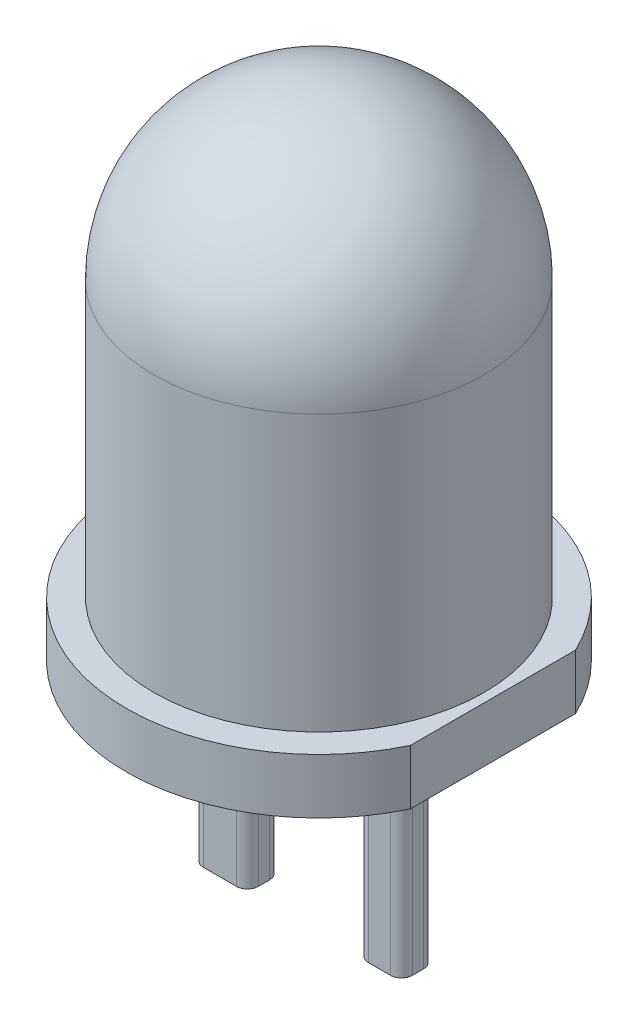
ISO-10303-21;
HEADER;
FILE_DESCRIPTION(('STEP AP214'),'2;1');
FILE_NAME('part.step','',(''),(''),'','','');
FILE_SCHEMA(('AUTOMOTIVE_DESIGN { 1 0 10303 214 1 1 1 1 }'));
ENDSEC;
DATA;
#1=APPLICATION_CONTEXT('core data for automotive mechanical design processes');
#2=APPLICATION_PROTOCOL_DEFINITION('international standard','automotive_design',2000,#1);
#3=PRODUCT_CONTEXT('',#1,'mechanical');
#4=PRODUCT('Part','Part','',(#3));
#5=PRODUCT_RELATED_PRODUCT_CATEGORY('part','',(#4));
#6=PRODUCT_DEFINITION_FORMATION('','',#4);
#7=PRODUCT_DEFINITION_CONTEXT('part definition',#1,'design');
#8=PRODUCT_DEFINITION('design','',#6,#7);
#9=PRODUCT_DEFINITION_SHAPE('','',#8);
#10=(LENGTH_UNIT() NAMED_UNIT(*) SI_UNIT(.MILLI.,.METRE.));
#11=(NAMED_UNIT(*) PLANE_ANGLE_UNIT() SI_UNIT($,.RADIAN.));
#12=(NAMED_UNIT(*) SI_UNIT($,.STERADIAN.) SOLID_ANGLE_UNIT());
#13=UNCERTAINTY_MEASURE_WITH_UNIT(LENGTH_MEASURE(1.E-05),#10,'distance_accuracy_value','');
#14=(GEOMETRIC_REPRESENTATION_CONTEXT(3) GLOBAL_UNCERTAINTY_ASSIGNED_CONTEXT((#13)) GLOBAL_UNIT_ASSIGNED_CONTEXT((#10,
#11,#12)) REPRESENTATION_CONTEXT('',''));
#15=CARTESIAN_POINT('',(0.,0.,0.));
#16=DIRECTION('',(0.,0.,1.));
#17=DIRECTION('',(1.,0.,0.));
#18=AXIS2_PLACEMENT_3D('',#15,#16,#17);
#19=CARTESIAN_POINT('',(0.,0.,0.));
#20=DIRECTION('',(0.,1.,0.));
#21=DIRECTION('',(0.,0.,1.));
#22=AXIS2_PLACEMENT_3D('',#19,#20,#21);
#23=PLANE('',#22);
#24=CARTESIAN_POINT('',(0.8,0.,0.05));
#25=DIRECTION('',(0.,-1.,0.));
#26=DIRECTION('',(0.,0.,1.));
#27=AXIS2_PLACEMENT_3D('',#24,#25,#26);
#28=CIRCLE('',#27,0.1);
#29=CARTESIAN_POINT('',(0.9,0.,0.0499999999999993));
#30=VERTEX_POINT('',#29);
#31=CARTESIAN_POINT('',(0.799999999999999,0.,0.15));
#32=VERTEX_POINT('',#31);
#33=EDGE_CURVE('E190',#30,#32,#28,.T.);
#34=ORIENTED_EDGE('',*,*,#33,.F.);
#35=DIRECTION('',(0.,0.,1.));
#36=VECTOR('',#35,1.);
#37=CARTESIAN_POINT('',(0.9,0.,0.0499999999999993));
#38=LINE('',#37,#36);
#39=CARTESIAN_POINT('',(0.9,0.,-0.0499999999999993));
#40=VERTEX_POINT('',#39);
#41=EDGE_CURVE('E203',#40,#30,#38,.T.);
#42=ORIENTED_EDGE('',*,*,#41,.F.);
#43=CARTESIAN_POINT('',(0.8,0.,-0.05));
#44=DIRECTION('',(0.,-1.,0.));
#45=DIRECTION('',(0.,0.,-1.));
#46=AXIS2_PLACEMENT_3D('',#43,#44,#45);
#47=CIRCLE('',#46,0.1);
#48=CARTESIAN_POINT('',(0.799999999999999,0.,-0.15));
#49=VERTEX_POINT('',#48);
#50=EDGE_CURVE('E232',#49,#40,#47,.T.);
#51=ORIENTED_EDGE('',*,*,#50,.F.);
#52=DIRECTION('',(1.,0.,0.));
#53=VECTOR('',#52,1.);
#54=CARTESIAN_POINT('',(0.600000000000001,0.,-0.15));
#55=LINE('',#54,#53);
#56=CARTESIAN_POINT('',(0.600000000000001,0.,-0.15));
#57=VERTEX_POINT('',#56);
#58=EDGE_CURVE('E229',#57,#49,#55,.T.);
#59=ORIENTED_EDGE('',*,*,#58,.F.);
#60=CARTESIAN_POINT('',(0.6,0.,-0.05));
#61=DIRECTION('',(0.,-1.,0.));
#62=DIRECTION('',(0.,0.,-1.));
#63=AXIS2_PLACEMENT_3D('',#60,#61,#62);
#64=CIRCLE('',#63,0.1);
#65=CARTESIAN_POINT('',(0.5,0.,-0.0499999999999993));
#66=VERTEX_POINT('',#65);
#67=EDGE_CURVE('E226',#66,#57,#64,.T.);
#68=ORIENTED_EDGE('',*,*,#67,.F.);
#69=DIRECTION('',(0.,0.,-1.));
#70=VECTOR('',#69,1.);
#71=CARTESIAN_POINT('',(0.5,0.,0.0499999999999993));
#72=LINE('',#71,#70);
#73=CARTESIAN_POINT('',(0.5,0.,0.0499999999999993));
#74=VERTEX_POINT('',#73);
#75=EDGE_CURVE('E223',#74,#66,#72,.T.);
#76=ORIENTED_EDGE('',*,*,#75,.F.);
#77=CARTESIAN_POINT('',(0.6,0.,0.05));
#78=DIRECTION('',(0.,-1.,0.));
#79=DIRECTION('',(0.,0.,-1.));
#80=AXIS2_PLACEMENT_3D('',#77,#78,#79);
#81=CIRCLE('',#80,0.1);
#82=CARTESIAN_POINT('',(0.6,0.,0.15));
#83=VERTEX_POINT('',#82);
#84=EDGE_CURVE('E220',#83,#74,#81,.T.);
#85=ORIENTED_EDGE('',*,*,#84,.F.);
#86=DIRECTION('',(-1.,0.,0.));
#87=VECTOR('',#86,1.);
#88=CARTESIAN_POINT('',(0.600000000000001,0.,0.15));
#89=LINE('',#88,#87);
#90=EDGE_CURVE('E193',#32,#83,#89,.T.);
#91=ORIENTED_EDGE('',*,*,#90,.F.);
#92=EDGE_LOOP('',(#34,#42,#51,#59,#68,#76,#85,#91));
#93=FACE_BOUND('',#92,.T.);
#94=CARTESIAN_POINT('',(0.,0.,0.));
#95=DIRECTION('',(0.,-1.,0.));
#96=DIRECTION('',(0.,0.,-1.));
#97=AXIS2_PLACEMENT_3D('',#94,#95,#96);
#98=CIRCLE('',#97,1.75);
#99=CARTESIAN_POINT('',(1.58113883008419,0.,0.75));
#100=VERTEX_POINT('',#99);
#101=CARTESIAN_POINT('',(1.58113883008419,0.,-0.75));
#102=VERTEX_POINT('',#101);
#103=EDGE_CURVE('E52',#100,#102,#98,.T.);
#104=ORIENTED_EDGE('',*,*,#103,.T.);
#105=DIRECTION('',(0.,0.,-1.));
#106=VECTOR('',#105,1.);
#107=CARTESIAN_POINT('',(1.58113883008419,0.,-0.75));
#108=LINE('',#107,#106);
#109=EDGE_CURVE('E260',#100,#102,#108,.T.);
#110=ORIENTED_EDGE('',*,*,#109,.F.);
#111=EDGE_LOOP('',(#104,#110));
#112=FACE_BOUND('',#111,.T.);
#113=CARTESIAN_POINT('',(-0.6,0.,-0.05));
#114=DIRECTION('',(0.,-1.,0.));
#115=DIRECTION('',(0.,0.,-1.));
#116=AXIS2_PLACEMENT_3D('',#113,#114,#115);
#117=CIRCLE('',#116,0.1);
#118=CARTESIAN_POINT('',(-0.600000000000001,0.,-0.15));
#119=VERTEX_POINT('',#118);
#120=CARTESIAN_POINT('',(-0.5,0.,-0.0499999999999993));
#121=VERTEX_POINT('',#120);
#122=EDGE_CURVE('E189',#119,#121,#117,.T.);
#123=ORIENTED_EDGE('',*,*,#122,.F.);
#124=DIRECTION('',(1.,0.,0.));
#125=VECTOR('',#124,1.);
#126=CARTESIAN_POINT('',(-0.899999999999999,0.,-0.15));
#127=LINE('',#126,#125);
#128=CARTESIAN_POINT('',(-0.899999999999999,0.,-0.15));
#129=VERTEX_POINT('',#128);
#130=EDGE_CURVE('E186',#129,#119,#127,.T.);
#131=ORIENTED_EDGE('',*,*,#130,.F.);
#132=CARTESIAN_POINT('',(-0.9,0.,-0.05));
#133=DIRECTION('',(0.,-1.,0.));
#134=DIRECTION('',(0.,0.,-1.));
#135=AXIS2_PLACEMENT_3D('',#132,#133,#134);
#136=CIRCLE('',#135,0.1);
#137=CARTESIAN_POINT('',(-1.,0.,-0.0499999999999993));
#138=VERTEX_POINT('',#137);
#139=EDGE_CURVE('E515',#138,#129,#136,.T.);
#140=ORIENTED_EDGE('',*,*,#139,.F.);
#141=DIRECTION('',(0.,0.,-1.));
#142=VECTOR('',#141,1.);
#143=CARTESIAN_POINT('',(-1.,0.,0.0499999999999993));
#144=LINE('',#143,#142);
#145=CARTESIAN_POINT('',(-1.,0.,0.0499999999999993));
#146=VERTEX_POINT('',#145);
#147=EDGE_CURVE('E546',#146,#138,#144,.T.);
#148=ORIENTED_EDGE('',*,*,#147,.F.);
#149=CARTESIAN_POINT('',(-0.9,0.,0.05));
#150=DIRECTION('',(0.,-1.,0.));
#151=DIRECTION('',(0.,0.,-1.));
#152=AXIS2_PLACEMENT_3D('',#149,#150,#151);
#153=CIRCLE('',#152,0.1);
#154=CARTESIAN_POINT('',(-0.9,0.,0.15));
#155=VERTEX_POINT('',#154);
#156=EDGE_CURVE('E539',#155,#146,#153,.T.);
#157=ORIENTED_EDGE('',*,*,#156,.F.);
#158=DIRECTION('',(-1.,0.,0.));
#159=VECTOR('',#158,1.);
#160=CARTESIAN_POINT('',(-0.899999999999999,0.,0.15));
#161=LINE('',#160,#159);
#162=CARTESIAN_POINT('',(-0.600000000000001,0.,0.15));
#163=VERTEX_POINT('',#162);
#164=EDGE_CURVE('E536',#163,#155,#161,.T.);
#165=ORIENTED_EDGE('',*,*,#164,.F.);
#166=CARTESIAN_POINT('',(-0.6,0.,0.05));
#167=DIRECTION('',(0.,-1.,0.));
#168=DIRECTION('',(0.,0.,1.));
#169=AXIS2_PLACEMENT_3D('',#166,#167,#168);
#170=CIRCLE('',#169,0.1);
#171=CARTESIAN_POINT('',(-0.5,0.,0.0499999999999993));
#172=VERTEX_POINT('',#171);
#173=EDGE_CURVE('E64',#172,#163,#170,.T.);
#174=ORIENTED_EDGE('',*,*,#173,.F.);
#175=DIRECTION('',(0.,0.,1.));
#176=VECTOR('',#175,1.);
#177=CARTESIAN_POINT('',(-0.5,0.,0.0499999999999993));
#178=LINE('',#177,#176);
#179=EDGE_CURVE('E59',#121,#172,#178,.T.);
#180=ORIENTED_EDGE('',*,*,#179,.F.);
#181=EDGE_LOOP('',(#123,#131,#140,#148,#157,#165,#174,#180));
#182=FACE_BOUND('',#181,.T.);
#183=ADVANCED_FACE('F45',(#93,#112,#182),#23,.F.);
#184=CARTESIAN_POINT('',(0.,0.,0.));
#185=DIRECTION('',(0.,-1.,0.));
#186=DIRECTION('',(0.,0.,-1.));
#187=AXIS2_PLACEMENT_3D('',#184,#185,#186);
#188=CYLINDRICAL_SURFACE('',#187,1.75);
#189=CARTESIAN_POINT('',(0.,0.5,0.));
#190=DIRECTION('',(0.,-1.,0.));
#191=DIRECTION('',(0.,0.,-1.));
#192=AXIS2_PLACEMENT_3D('',#189,#190,#191);
#193=CIRCLE('',#192,1.75);
#194=CARTESIAN_POINT('',(1.58113883008419,0.5,0.75));
#195=VERTEX_POINT('',#194);
#196=CARTESIAN_POINT('',(1.58113883008419,0.5,-0.75));
#197=VERTEX_POINT('',#196);
#198=EDGE_CURVE('E273',#195,#197,#193,.T.);
#199=ORIENTED_EDGE('',*,*,#198,.T.);
#200=DIRECTION('',(0.,-1.,0.));
#201=VECTOR('',#200,1.);
#202=CARTESIAN_POINT('',(1.58113883008419,1.,-0.75));
#203=LINE('',#202,#201);
#204=EDGE_CURVE('E263',#197,#102,#203,.T.);
#205=ORIENTED_EDGE('',*,*,#204,.T.);
#206=ORIENTED_EDGE('',*,*,#103,.F.);
#207=DIRECTION('',(0.,-1.,0.));
#208=VECTOR('',#207,1.);
#209=CARTESIAN_POINT('',(1.58113883008419,1.,0.75));
#210=LINE('',#209,#208);
#211=EDGE_CURVE('E262',#195,#100,#210,.T.);
#212=ORIENTED_EDGE('',*,*,#211,.F.);
#213=EDGE_LOOP('',(#199,#205,#206,#212));
#214=FACE_BOUND('',#213,.T.);
#215=ADVANCED_FACE('F281',(#214),#188,.T.);
#216=CARTESIAN_POINT('',(-1.75,0.5,0.));
#217=DIRECTION('',(0.,-1.,0.));
#218=DIRECTION('',(0.,0.,-1.));
#219=AXIS2_PLACEMENT_3D('',#216,#217,#218);
#220=PLANE('',#219);
#221=ORIENTED_EDGE('',*,*,#198,.F.);
#222=DIRECTION('',(0.,0.,-1.));
#223=VECTOR('',#222,1.);
#224=CARTESIAN_POINT('',(1.58113883008419,0.5,0.));
#225=LINE('',#224,#223);
#226=EDGE_CURVE('E11',#195,#197,#225,.T.);
#227=ORIENTED_EDGE('',*,*,#226,.T.);
#228=EDGE_LOOP('',(#221,#227));
#229=FACE_BOUND('',#228,.T.);
#230=CARTESIAN_POINT('',(0.,0.5,0.));
#231=DIRECTION('',(0.,-1.,0.));
#232=DIRECTION('',(0.,0.,-1.));
#233=AXIS2_PLACEMENT_3D('',#230,#231,#232);
#234=CIRCLE('',#233,1.5);
#235=CARTESIAN_POINT('',(0.,0.5,-1.5));
#236=VERTEX_POINT('',#235);
#237=EDGE_CURVE('E270',#236,#236,#234,.T.);
#238=ORIENTED_EDGE('',*,*,#237,.T.);
#239=EDGE_LOOP('',(#238));
#240=FACE_BOUND('',#239,.T.);
#241=ADVANCED_FACE('F286',(#229,#240),#220,.F.);
#242=CARTESIAN_POINT('',(0.,0.,0.));
#243=DIRECTION('',(0.,-1.,0.));
#244=DIRECTION('',(0.,0.,-1.));
#245=AXIS2_PLACEMENT_3D('',#242,#243,#244);
#246=CYLINDRICAL_SURFACE('',#245,1.5);
#247=ORIENTED_EDGE('',*,*,#237,.F.);
#248=EDGE_LOOP('',(#247));
#249=FACE_BOUND('',#248,.T.);
#250=CARTESIAN_POINT('',(0.,3.00000000000001,0.));
#251=DIRECTION('',(0.,-1.,0.));
#252=DIRECTION('',(0.,0.,-1.));
#253=AXIS2_PLACEMENT_3D('',#250,#251,#252);
#254=CIRCLE('',#253,1.5);
#255=CARTESIAN_POINT('',(0.,3.00000000000001,-1.5));
#256=VERTEX_POINT('',#255);
#257=EDGE_CURVE('E266',#256,#256,#254,.T.);
#258=ORIENTED_EDGE('',*,*,#257,.T.);
#259=EDGE_LOOP('',(#258));
#260=FACE_BOUND('',#259,.T.);
#261=ADVANCED_FACE('F289',(#249,#260),#246,.T.);
#262=CARTESIAN_POINT('',(0.,3.00000000000001,0.));
#263=DIRECTION('',(0.,-1.,0.));
#264=DIRECTION('',(1.,0.,0.));
#265=AXIS2_PLACEMENT_3D('',#262,#263,#264);
#266=SPHERICAL_SURFACE('',#265,1.49999999999999);
#267=ORIENTED_EDGE('',*,*,#257,.F.);
#268=EDGE_LOOP('',(#267));
#269=FACE_BOUND('',#268,.T.);
#270=ADVANCED_FACE('F295',(#269),#266,.T.);
#271=CARTESIAN_POINT('',(1.58113883008419,1.,-0.75));
#272=DIRECTION('',(-1.,0.,0.));
#273=DIRECTION('',(0.,0.,1.));
#274=AXIS2_PLACEMENT_3D('',#271,#272,#273);
#275=PLANE('',#274);
#276=ORIENTED_EDGE('',*,*,#211,.T.);
#277=ORIENTED_EDGE('',*,*,#109,.T.);
#278=ORIENTED_EDGE('',*,*,#204,.F.);
#279=ORIENTED_EDGE('',*,*,#226,.F.);
#280=EDGE_LOOP('',(#276,#277,#278,#279));
#281=FACE_BOUND('',#280,.T.);
#282=ADVANCED_FACE('F284',(#281),#275,.F.);
#283=CARTESIAN_POINT('',(0.8,-2.,0.05));
#284=DIRECTION('',(0.,1.,0.));
#285=DIRECTION('',(0.,0.,1.));
#286=AXIS2_PLACEMENT_3D('',#283,#284,#285);
#287=CYLINDRICAL_SURFACE('',#286,0.1);
#288=ORIENTED_EDGE('',*,*,#33,.T.);
#289=DIRECTION('',(0.,1.,0.));
#290=VECTOR('',#289,1.);
#291=CARTESIAN_POINT('',(0.799999999999999,-2.,0.15));
#292=LINE('',#291,#290);
#293=CARTESIAN_POINT('',(0.799999999999999,-2.,0.15));
#294=VERTEX_POINT('',#293);
#295=EDGE_CURVE('E257',#294,#32,#292,.T.);
#296=ORIENTED_EDGE('',*,*,#295,.F.);
#297=CARTESIAN_POINT('',(0.8,-2.,0.05));
#298=DIRECTION('',(0.,-1.,0.));
#299=DIRECTION('',(0.,0.,1.));
#300=AXIS2_PLACEMENT_3D('',#297,#298,#299);
#301=CIRCLE('',#300,0.1);
#302=CARTESIAN_POINT('',(0.9,-2.,0.0499999999999993));
#303=VERTEX_POINT('',#302);
#304=EDGE_CURVE('E199',#303,#294,#301,.T.);
#305=ORIENTED_EDGE('',*,*,#304,.F.);
#306=DIRECTION('',(0.,1.,0.));
#307=VECTOR('',#306,1.);
#308=CARTESIAN_POINT('',(0.9,-2.,0.0499999999999993));
#309=LINE('',#308,#307);
#310=EDGE_CURVE('E216',#303,#30,#309,.T.);
#311=ORIENTED_EDGE('',*,*,#310,.T.);
#312=EDGE_LOOP('',(#288,#296,#305,#311));
#313=FACE_BOUND('',#312,.T.);
#314=ADVANCED_FACE('F304',(#313),#287,.T.);
#315=CARTESIAN_POINT('',(0.600000000000001,-2.,0.15));
#316=DIRECTION('',(0.,0.,-1.));
#317=DIRECTION('',(-1.,0.,0.));
#318=AXIS2_PLACEMENT_3D('',#315,#316,#317);
#319=PLANE('',#318);
#320=ORIENTED_EDGE('',*,*,#90,.T.);
#321=DIRECTION('',(0.,1.,0.));
#322=VECTOR('',#321,1.);
#323=CARTESIAN_POINT('',(0.600000000000001,-2.,0.15));
#324=LINE('',#323,#322);
#325=CARTESIAN_POINT('',(0.600000000000001,-2.,0.15));
#326=VERTEX_POINT('',#325);
#327=EDGE_CURVE('E254',#326,#83,#324,.T.);
#328=ORIENTED_EDGE('',*,*,#327,.F.);
#329=DIRECTION('',(-1.,0.,0.));
#330=VECTOR('',#329,1.);
#331=CARTESIAN_POINT('',(0.600000000000001,-2.,0.15));
#332=LINE('',#331,#330);
#333=EDGE_CURVE('E202',#294,#326,#332,.T.);
#334=ORIENTED_EDGE('',*,*,#333,.F.);
#335=ORIENTED_EDGE('',*,*,#295,.T.);
#336=EDGE_LOOP('',(#320,#328,#334,#335));
#337=FACE_BOUND('',#336,.T.);
#338=ADVANCED_FACE('F342',(#337),#319,.F.);
#339=CARTESIAN_POINT('',(0.6,-2.,0.05));
#340=DIRECTION('',(0.,1.,0.));
#341=DIRECTION('',(0.,0.,1.));
#342=AXIS2_PLACEMENT_3D('',#339,#340,#341);
#343=CYLINDRICAL_SURFACE('',#342,0.1);
#344=ORIENTED_EDGE('',*,*,#84,.T.);
#345=DIRECTION('',(0.,1.,0.));
#346=VECTOR('',#345,1.);
#347=CARTESIAN_POINT('',(0.5,-2.,0.0499999999999993));
#348=LINE('',#347,#346);
#349=CARTESIAN_POINT('',(0.5,-2.,0.0499999999999993));
#350=VERTEX_POINT('',#349);
#351=EDGE_CURVE('E251',#350,#74,#348,.T.);
#352=ORIENTED_EDGE('',*,*,#351,.F.);
#353=CARTESIAN_POINT('',(0.6,-2.,0.05));
#354=DIRECTION('',(0.,-1.,0.));
#355=DIRECTION('',(0.,0.,-1.));
#356=AXIS2_PLACEMENT_3D('',#353,#354,#355);
#357=CIRCLE('',#356,0.1);
#358=EDGE_CURVE('E205',#326,#350,#357,.T.);
#359=ORIENTED_EDGE('',*,*,#358,.F.);
#360=ORIENTED_EDGE('',*,*,#327,.T.);
#361=EDGE_LOOP('',(#344,#352,#359,#360));
#362=FACE_BOUND('',#361,.T.);
#363=ADVANCED_FACE('F340',(#362),#343,.T.);
#364=CARTESIAN_POINT('',(0.5,-2.,0.0499999999999993));
#365=DIRECTION('',(1.,0.,0.));
#366=DIRECTION('',(0.,0.,-1.));
#367=AXIS2_PLACEMENT_3D('',#364,#365,#366);
#368=PLANE('',#367);
#369=ORIENTED_EDGE('',*,*,#75,.T.);
#370=DIRECTION('',(0.,1.,0.));
#371=VECTOR('',#370,1.);
#372=CARTESIAN_POINT('',(0.5,-2.,-0.0499999999999993));
#373=LINE('',#372,#371);
#374=CARTESIAN_POINT('',(0.5,-2.,-0.0499999999999993));
#375=VERTEX_POINT('',#374);
#376=EDGE_CURVE('E248',#375,#66,#373,.T.);
#377=ORIENTED_EDGE('',*,*,#376,.F.);
#378=DIRECTION('',(0.,0.,-1.));
#379=VECTOR('',#378,1.);
#380=CARTESIAN_POINT('',(0.5,-2.,0.0499999999999993));
#381=LINE('',#380,#379);
#382=EDGE_CURVE('E207',#350,#375,#381,.T.);
#383=ORIENTED_EDGE('',*,*,#382,.F.);
#384=ORIENTED_EDGE('',*,*,#351,.T.);
#385=EDGE_LOOP('',(#369,#377,#383,#384));
#386=FACE_BOUND('',#385,.T.);
#387=ADVANCED_FACE('F335',(#386),#368,.F.);
#388=CARTESIAN_POINT('',(0.6,-2.,-0.05));
#389=DIRECTION('',(0.,1.,0.));
#390=DIRECTION('',(0.,0.,1.));
#391=AXIS2_PLACEMENT_3D('',#388,#389,#390);
#392=CYLINDRICAL_SURFACE('',#391,0.1);
#393=ORIENTED_EDGE('',*,*,#67,.T.);
#394=DIRECTION('',(0.,1.,0.));
#395=VECTOR('',#394,1.);
#396=CARTESIAN_POINT('',(0.600000000000001,-2.,-0.15));
#397=LINE('',#396,#395);
#398=CARTESIAN_POINT('',(0.600000000000001,-2.,-0.15));
#399=VERTEX_POINT('',#398);
#400=EDGE_CURVE('E245',#399,#57,#397,.T.);
#401=ORIENTED_EDGE('',*,*,#400,.F.);
#402=CARTESIAN_POINT('',(0.6,-2.,-0.05));
#403=DIRECTION('',(0.,-1.,0.));
#404=DIRECTION('',(0.,0.,-1.));
#405=AXIS2_PLACEMENT_3D('',#402,#403,#404);
#406=CIRCLE('',#405,0.1);
#407=EDGE_CURVE('E209',#375,#399,#406,.T.);
#408=ORIENTED_EDGE('',*,*,#407,.F.);
#409=ORIENTED_EDGE('',*,*,#376,.T.);
#410=EDGE_LOOP('',(#393,#401,#408,#409));
#411=FACE_BOUND('',#410,.T.);
#412=ADVANCED_FACE('F332',(#411),#392,.T.);
#413=CARTESIAN_POINT('',(0.600000000000001,-2.,-0.15));
#414=DIRECTION('',(0.,0.,1.));
#415=DIRECTION('',(1.,0.,0.));
#416=AXIS2_PLACEMENT_3D('',#413,#414,#415);
#417=PLANE('',#416);
#418=ORIENTED_EDGE('',*,*,#58,.T.);
#419=DIRECTION('',(0.,1.,0.));
#420=VECTOR('',#419,1.);
#421=CARTESIAN_POINT('',(0.799999999999999,-2.,-0.15));
#422=LINE('',#421,#420);
#423=CARTESIAN_POINT('',(0.799999999999999,-2.,-0.15));
#424=VERTEX_POINT('',#423);
#425=EDGE_CURVE('E242',#424,#49,#422,.T.);
#426=ORIENTED_EDGE('',*,*,#425,.F.);
#427=DIRECTION('',(1.,0.,0.));
#428=VECTOR('',#427,1.);
#429=CARTESIAN_POINT('',(0.600000000000001,-2.,-0.15));
#430=LINE('',#429,#428);
#431=EDGE_CURVE('E211',#399,#424,#430,.T.);
#432=ORIENTED_EDGE('',*,*,#431,.F.);
#433=ORIENTED_EDGE('',*,*,#400,.T.);
#434=EDGE_LOOP('',(#418,#426,#432,#433));
#435=FACE_BOUND('',#434,.T.);
#436=ADVANCED_FACE('F328',(#435),#417,.F.);
#437=CARTESIAN_POINT('',(0.8,-2.,-0.05));
#438=DIRECTION('',(0.,1.,0.));
#439=DIRECTION('',(0.,0.,1.));
#440=AXIS2_PLACEMENT_3D('',#437,#438,#439);
#441=CYLINDRICAL_SURFACE('',#440,0.1);
#442=ORIENTED_EDGE('',*,*,#50,.T.);
#443=DIRECTION('',(0.,1.,0.));
#444=VECTOR('',#443,1.);
#445=CARTESIAN_POINT('',(0.9,-2.,-0.0499999999999993));
#446=LINE('',#445,#444);
#447=CARTESIAN_POINT('',(0.9,-2.,-0.0499999999999993));
#448=VERTEX_POINT('',#447);
#449=EDGE_CURVE('E239',#448,#40,#446,.T.);
#450=ORIENTED_EDGE('',*,*,#449,.F.);
#451=CARTESIAN_POINT('',(0.8,-2.,-0.05));
#452=DIRECTION('',(0.,-1.,0.));
#453=DIRECTION('',(0.,0.,-1.));
#454=AXIS2_PLACEMENT_3D('',#451,#452,#453);
#455=CIRCLE('',#454,0.1);
#456=EDGE_CURVE('E213',#424,#448,#455,.T.);
#457=ORIENTED_EDGE('',*,*,#456,.F.);
#458=ORIENTED_EDGE('',*,*,#425,.T.);
#459=EDGE_LOOP('',(#442,#450,#457,#458));
#460=FACE_BOUND('',#459,.T.);
#461=ADVANCED_FACE('F326',(#460),#441,.T.);
#462=CARTESIAN_POINT('',(0.9,-2.,0.0499999999999993));
#463=DIRECTION('',(-1.,0.,0.));
#464=DIRECTION('',(0.,0.,1.));
#465=AXIS2_PLACEMENT_3D('',#462,#463,#464);
#466=PLANE('',#465);
#467=ORIENTED_EDGE('',*,*,#41,.T.);
#468=ORIENTED_EDGE('',*,*,#310,.F.);
#469=DIRECTION('',(0.,0.,1.));
#470=VECTOR('',#469,1.);
#471=CARTESIAN_POINT('',(0.9,-2.,0.0499999999999993));
#472=LINE('',#471,#470);
#473=EDGE_CURVE('E215',#448,#303,#472,.T.);
#474=ORIENTED_EDGE('',*,*,#473,.F.);
#475=ORIENTED_EDGE('',*,*,#449,.T.);
#476=EDGE_LOOP('',(#467,#468,#474,#475));
#477=FACE_BOUND('',#476,.T.);
#478=ADVANCED_FACE('F315',(#477),#466,.F.);
#479=CARTESIAN_POINT('',(0.8,-2.,0.05));
#480=DIRECTION('',(0.,1.,0.));
#481=DIRECTION('',(0.,0.,1.));
#482=AXIS2_PLACEMENT_3D('',#479,#480,#481);
#483=PLANE('',#482);
#484=ORIENTED_EDGE('',*,*,#304,.T.);
#485=ORIENTED_EDGE('',*,*,#333,.T.);
#486=ORIENTED_EDGE('',*,*,#358,.T.);
#487=ORIENTED_EDGE('',*,*,#382,.T.);
#488=ORIENTED_EDGE('',*,*,#407,.T.);
#489=ORIENTED_EDGE('',*,*,#431,.T.);
#490=ORIENTED_EDGE('',*,*,#456,.T.);
#491=ORIENTED_EDGE('',*,*,#473,.T.);
#492=EDGE_LOOP('',(#484,#485,#486,#487,#488,#489,#490,#491));
#493=FACE_BOUND('',#492,.T.);
#494=ADVANCED_FACE('F320',(#493),#483,.F.);
#495=CARTESIAN_POINT('',(-0.6,-2.,-0.05));
#496=DIRECTION('',(0.,1.,0.));
#497=DIRECTION('',(0.,0.,1.));
#498=AXIS2_PLACEMENT_3D('',#495,#496,#497);
#499=CYLINDRICAL_SURFACE('',#498,0.1);
#500=ORIENTED_EDGE('',*,*,#122,.T.);
#501=DIRECTION('',(0.,1.,0.));
#502=VECTOR('',#501,1.);
#503=CARTESIAN_POINT('',(-0.5,-2.,-0.0499999999999993));
#504=LINE('',#503,#502);
#505=CARTESIAN_POINT('',(-0.5,-2.,-0.0499999999999993));
#506=VERTEX_POINT('',#505);
#507=EDGE_CURVE('E170',#506,#121,#504,.T.);
#508=ORIENTED_EDGE('',*,*,#507,.F.);
#509=CARTESIAN_POINT('',(-0.6,-2.,-0.05));
#510=DIRECTION('',(0.,-1.,0.));
#511=DIRECTION('',(0.,0.,-1.));
#512=AXIS2_PLACEMENT_3D('',#509,#510,#511);
#513=CIRCLE('',#512,0.1);
#514=CARTESIAN_POINT('',(-0.600000000000001,-2.,-0.15));
#515=VERTEX_POINT('',#514);
#516=EDGE_CURVE('E177',#515,#506,#513,.T.);
#517=ORIENTED_EDGE('',*,*,#516,.F.);
#518=DIRECTION('',(0.,1.,0.));
#519=VECTOR('',#518,1.);
#520=CARTESIAN_POINT('',(-0.600000000000001,-2.,-0.15));
#521=LINE('',#520,#519);
#522=EDGE_CURVE('E511',#515,#119,#521,.T.);
#523=ORIENTED_EDGE('',*,*,#522,.T.);
#524=EDGE_LOOP('',(#500,#508,#517,#523));
#525=FACE_BOUND('',#524,.T.);
#526=ADVANCED_FACE('F188',(#525),#499,.T.);
#527=CARTESIAN_POINT('',(-0.5,-2.,0.0499999999999993));
#528=DIRECTION('',(-1.,0.,0.));
#529=DIRECTION('',(0.,0.,1.));
#530=AXIS2_PLACEMENT_3D('',#527,#528,#529);
#531=PLANE('',#530);
#532=ORIENTED_EDGE('',*,*,#179,.T.);
#533=DIRECTION('',(0.,1.,0.));
#534=VECTOR('',#533,1.);
#535=CARTESIAN_POINT('',(-0.5,-2.,0.0499999999999993));
#536=LINE('',#535,#534);
#537=CARTESIAN_POINT('',(-0.5,-2.,0.0499999999999993));
#538=VERTEX_POINT('',#537);
#539=EDGE_CURVE('E173',#538,#172,#536,.T.);
#540=ORIENTED_EDGE('',*,*,#539,.F.);
#541=DIRECTION('',(0.,0.,1.));
#542=VECTOR('',#541,1.);
#543=CARTESIAN_POINT('',(-0.5,-2.,0.0499999999999993));
#544=LINE('',#543,#542);
#545=EDGE_CURVE('E166',#506,#538,#544,.T.);
#546=ORIENTED_EDGE('',*,*,#545,.F.);
#547=ORIENTED_EDGE('',*,*,#507,.T.);
#548=EDGE_LOOP('',(#532,#540,#546,#547));
#549=FACE_BOUND('',#548,.T.);
#550=ADVANCED_FACE('F168',(#549),#531,.F.);
#551=CARTESIAN_POINT('',(-0.6,-2.,0.05));
#552=DIRECTION('',(0.,1.,0.));
#553=DIRECTION('',(0.,0.,1.));
#554=AXIS2_PLACEMENT_3D('',#551,#552,#553);
#555=CYLINDRICAL_SURFACE('',#554,0.1);
#556=ORIENTED_EDGE('',*,*,#173,.T.);
#557=DIRECTION('',(0.,1.,0.));
#558=VECTOR('',#557,1.);
#559=CARTESIAN_POINT('',(-0.600000000000001,-2.,0.15));
#560=LINE('',#559,#558);
#561=CARTESIAN_POINT('',(-0.600000000000001,-2.,0.15));
#562=VERTEX_POINT('',#561);
#563=EDGE_CURVE('E195',#562,#163,#560,.T.);
#564=ORIENTED_EDGE('',*,*,#563,.F.);
#565=CARTESIAN_POINT('',(-0.6,-2.,0.05));
#566=DIRECTION('',(0.,-1.,0.));
#567=DIRECTION('',(0.,0.,1.));
#568=AXIS2_PLACEMENT_3D('',#565,#566,#567);
#569=CIRCLE('',#568,0.1);
#570=EDGE_CURVE('E176',#538,#562,#569,.T.);
#571=ORIENTED_EDGE('',*,*,#570,.F.);
#572=ORIENTED_EDGE('',*,*,#539,.T.);
#573=EDGE_LOOP('',(#556,#564,#571,#572));
#574=FACE_BOUND('',#573,.T.);
#575=ADVANCED_FACE('F368',(#574),#555,.T.);
#576=CARTESIAN_POINT('',(-0.899999999999999,-2.,0.15));
#577=DIRECTION('',(0.,0.,-1.));
#578=DIRECTION('',(-1.,0.,0.));
#579=AXIS2_PLACEMENT_3D('',#576,#577,#578);
#580=PLANE('',#579);
#581=ORIENTED_EDGE('',*,*,#164,.T.);
#582=DIRECTION('',(0.,1.,0.));
#583=VECTOR('',#582,1.);
#584=CARTESIAN_POINT('',(-0.899999999999999,-2.,0.15));
#585=LINE('',#584,#583);
#586=CARTESIAN_POINT('',(-0.899999999999999,-2.,0.15));
#587=VERTEX_POINT('',#586);
#588=EDGE_CURVE('E529',#587,#155,#585,.T.);
#589=ORIENTED_EDGE('',*,*,#588,.F.);
#590=DIRECTION('',(-1.,0.,0.));
#591=VECTOR('',#590,1.);
#592=CARTESIAN_POINT('',(-0.899999999999999,-2.,0.15));
#593=LINE('',#592,#591);
#594=EDGE_CURVE('E537',#562,#587,#593,.T.);
#595=ORIENTED_EDGE('',*,*,#594,.F.);
#596=ORIENTED_EDGE('',*,*,#563,.T.);
#597=EDGE_LOOP('',(#581,#589,#595,#596));
#598=FACE_BOUND('',#597,.T.);
#599=ADVANCED_FACE('F371',(#598),#580,.F.);
#600=CARTESIAN_POINT('',(-0.9,-2.,0.05));
#601=DIRECTION('',(0.,1.,0.));
#602=DIRECTION('',(0.,0.,1.));
#603=AXIS2_PLACEMENT_3D('',#600,#601,#602);
#604=CYLINDRICAL_SURFACE('',#603,0.1);
#605=ORIENTED_EDGE('',*,*,#156,.T.);
#606=DIRECTION('',(0.,1.,0.));
#607=VECTOR('',#606,1.);
#608=CARTESIAN_POINT('',(-1.,-2.,0.0499999999999993));
#609=LINE('',#608,#607);
#610=CARTESIAN_POINT('',(-1.,-2.,0.0499999999999993));
#611=VERTEX_POINT('',#610);
#612=EDGE_CURVE('E526',#611,#146,#609,.T.);
#613=ORIENTED_EDGE('',*,*,#612,.F.);
#614=CARTESIAN_POINT('',(-0.9,-2.,0.05));
#615=DIRECTION('',(0.,-1.,0.));
#616=DIRECTION('',(0.,0.,-1.));
#617=AXIS2_PLACEMENT_3D('',#614,#615,#616);
#618=CIRCLE('',#617,0.1);
#619=EDGE_CURVE('E554',#587,#611,#618,.T.);
#620=ORIENTED_EDGE('',*,*,#619,.F.);
#621=ORIENTED_EDGE('',*,*,#588,.T.);
#622=EDGE_LOOP('',(#605,#613,#620,#621));
#623=FACE_BOUND('',#622,.T.);
#624=ADVANCED_FACE('F375',(#623),#604,.T.);
#625=CARTESIAN_POINT('',(-1.,-2.,0.0499999999999993));
#626=DIRECTION('',(1.,0.,0.));
#627=DIRECTION('',(0.,0.,-1.));
#628=AXIS2_PLACEMENT_3D('',#625,#626,#627);
#629=PLANE('',#628);
#630=ORIENTED_EDGE('',*,*,#147,.T.);
#631=DIRECTION('',(0.,1.,0.));
#632=VECTOR('',#631,1.);
#633=CARTESIAN_POINT('',(-1.,-2.,-0.0499999999999993));
#634=LINE('',#633,#632);
#635=CARTESIAN_POINT('',(-1.,-2.,-0.0499999999999993));
#636=VERTEX_POINT('',#635);
#637=EDGE_CURVE('E518',#636,#138,#634,.T.);
#638=ORIENTED_EDGE('',*,*,#637,.F.);
#639=DIRECTION('',(0.,0.,-1.));
#640=VECTOR('',#639,1.);
#641=CARTESIAN_POINT('',(-1.,-2.,0.0499999999999993));
#642=LINE('',#641,#640);
#643=EDGE_CURVE('E552',#611,#636,#642,.T.);
#644=ORIENTED_EDGE('',*,*,#643,.F.);
#645=ORIENTED_EDGE('',*,*,#612,.T.);
#646=EDGE_LOOP('',(#630,#638,#644,#645));
#647=FACE_BOUND('',#646,.T.);
#648=ADVANCED_FACE('F379',(#647),#629,.F.);
#649=CARTESIAN_POINT('',(-0.9,-2.,-0.05));
#650=DIRECTION('',(0.,1.,0.));
#651=DIRECTION('',(0.,0.,1.));
#652=AXIS2_PLACEMENT_3D('',#649,#650,#651);
#653=CYLINDRICAL_SURFACE('',#652,0.1);
#654=ORIENTED_EDGE('',*,*,#139,.T.);
#655=DIRECTION('',(0.,1.,0.));
#656=VECTOR('',#655,1.);
#657=CARTESIAN_POINT('',(-0.899999999999999,-2.,-0.15));
#658=LINE('',#657,#656);
#659=CARTESIAN_POINT('',(-0.899999999999999,-2.,-0.15));
#660=VERTEX_POINT('',#659);
#661=EDGE_CURVE('E513',#660,#129,#658,.T.);
#662=ORIENTED_EDGE('',*,*,#661,.F.);
#663=CARTESIAN_POINT('',(-0.9,-2.,-0.05));
#664=DIRECTION('',(0.,-1.,0.));
#665=DIRECTION('',(0.,0.,-1.));
#666=AXIS2_PLACEMENT_3D('',#663,#664,#665);
#667=CIRCLE('',#666,0.1);
#668=EDGE_CURVE('E520',#636,#660,#667,.T.);
#669=ORIENTED_EDGE('',*,*,#668,.F.);
#670=ORIENTED_EDGE('',*,*,#637,.T.);
#671=EDGE_LOOP('',(#654,#662,#669,#670));
#672=FACE_BOUND('',#671,.T.);
#673=ADVANCED_FACE('F383',(#672),#653,.T.);
#674=CARTESIAN_POINT('',(-0.899999999999999,-2.,-0.15));
#675=DIRECTION('',(0.,0.,1.));
#676=DIRECTION('',(1.,0.,0.));
#677=AXIS2_PLACEMENT_3D('',#674,#675,#676);
#678=PLANE('',#677);
#679=ORIENTED_EDGE('',*,*,#130,.T.);
#680=ORIENTED_EDGE('',*,*,#522,.F.);
#681=DIRECTION('',(1.,0.,0.));
#682=VECTOR('',#681,1.);
#683=CARTESIAN_POINT('',(-0.899999999999999,-2.,-0.15));
#684=LINE('',#683,#682);
#685=EDGE_CURVE('E182',#660,#515,#684,.T.);
#686=ORIENTED_EDGE('',*,*,#685,.F.);
#687=ORIENTED_EDGE('',*,*,#661,.T.);
#688=EDGE_LOOP('',(#679,#680,#686,#687));
#689=FACE_BOUND('',#688,.T.);
#690=ADVANCED_FACE('F387',(#689),#678,.F.);
#691=CARTESIAN_POINT('',(-0.6,-2.,-0.05));
#692=DIRECTION('',(0.,-1.,0.));
#693=DIRECTION('',(0.,0.,-1.));
#694=AXIS2_PLACEMENT_3D('',#691,#692,#693);
#695=PLANE('',#694);
#696=ORIENTED_EDGE('',*,*,#516,.T.);
#697=ORIENTED_EDGE('',*,*,#545,.T.);
#698=ORIENTED_EDGE('',*,*,#570,.T.);
#699=ORIENTED_EDGE('',*,*,#594,.T.);
#700=ORIENTED_EDGE('',*,*,#619,.T.);
#701=ORIENTED_EDGE('',*,*,#643,.T.);
#702=ORIENTED_EDGE('',*,*,#668,.T.);
#703=ORIENTED_EDGE('',*,*,#685,.T.);
#704=EDGE_LOOP('',(#696,#697,#698,#699,#700,#701,#702,#703));
#705=FACE_BOUND('',#704,.T.);
#706=ADVANCED_FACE('F180',(#705),#695,.T.);
#707=CLOSED_SHELL('',(#183,#215,#241,#261,#270,#282,#314,#338,#363,#387,#412,#436,#461,#478,
#494,#526,#550,#575,#599,#624,#648,#673,#690,#706));
#708=MANIFOLD_SOLID_BREP('B2',#707);
#709=ADVANCED_BREP_SHAPE_REPRESENTATION('',(#18,#708),#14);
#710=SHAPE_DEFINITION_REPRESENTATION(#9,#709);
ENDSEC;
END-ISO-10303-21;
